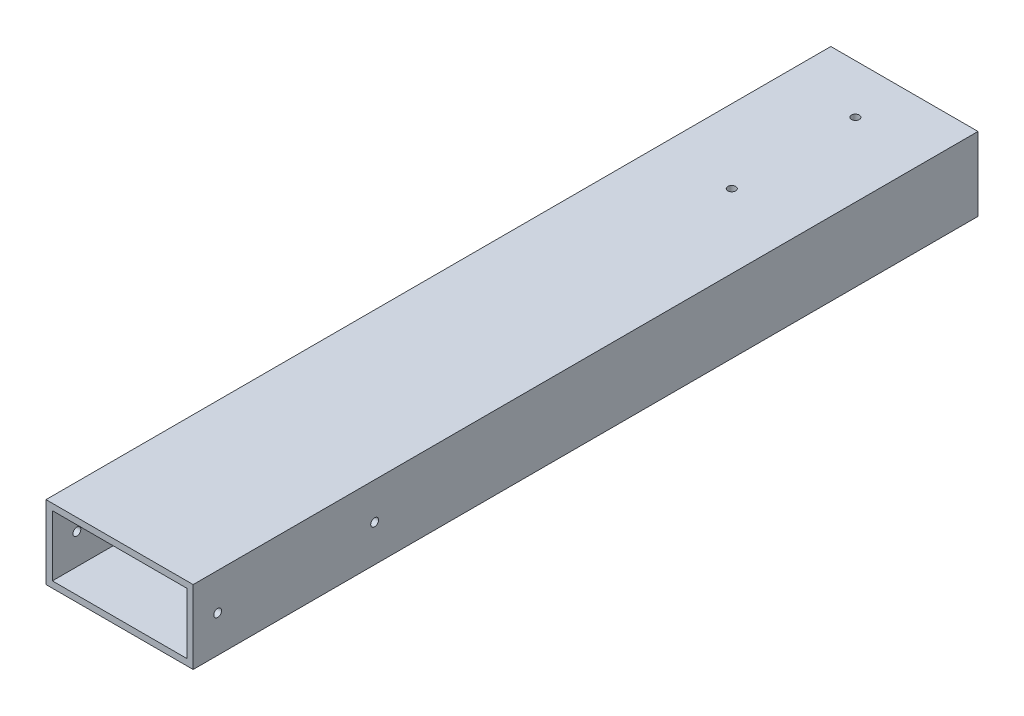
ISO-10303-21;
HEADER;
FILE_DESCRIPTION(('STEP AP214'),'2;1');
FILE_NAME('part.step','',(''),(''),'','','');
FILE_SCHEMA(('AUTOMOTIVE_DESIGN { 1 0 10303 214 1 1 1 1 }'));
ENDSEC;
DATA;
#1=APPLICATION_CONTEXT('core data for automotive mechanical design processes');
#2=APPLICATION_PROTOCOL_DEFINITION('international standard','automotive_design',2000,#1);
#3=PRODUCT_CONTEXT('',#1,'mechanical');
#4=PRODUCT('Part','Part','',(#3));
#5=PRODUCT_RELATED_PRODUCT_CATEGORY('part','',(#4));
#6=PRODUCT_DEFINITION_FORMATION('','',#4);
#7=PRODUCT_DEFINITION_CONTEXT('part definition',#1,'design');
#8=PRODUCT_DEFINITION('design','',#6,#7);
#9=PRODUCT_DEFINITION_SHAPE('','',#8);
#10=(LENGTH_UNIT() NAMED_UNIT(*) SI_UNIT(.MILLI.,.METRE.));
#11=(NAMED_UNIT(*) PLANE_ANGLE_UNIT() SI_UNIT($,.RADIAN.));
#12=(NAMED_UNIT(*) SI_UNIT($,.STERADIAN.) SOLID_ANGLE_UNIT());
#13=UNCERTAINTY_MEASURE_WITH_UNIT(LENGTH_MEASURE(1.E-05),#10,'distance_accuracy_value','');
#14=(GEOMETRIC_REPRESENTATION_CONTEXT(3) GLOBAL_UNCERTAINTY_ASSIGNED_CONTEXT((#13)) GLOBAL_UNIT_ASSIGNED_CONTEXT((#10,
#11,#12)) REPRESENTATION_CONTEXT('',''));
#15=CARTESIAN_POINT('',(0.,0.,0.));
#16=DIRECTION('',(0.,0.,1.));
#17=DIRECTION('',(1.,0.,0.));
#18=AXIS2_PLACEMENT_3D('',#15,#16,#17);
#19=CARTESIAN_POINT('',(-19.05,-9.525,203.2));
#20=DIRECTION('',(0.,0.,1.));
#21=DIRECTION('',(1.,0.,0.));
#22=AXIS2_PLACEMENT_3D('',#19,#20,#21);
#23=PLANE('',#22);
#24=DIRECTION('',(0.,-1.,0.));
#25=VECTOR('',#24,1.);
#26=CARTESIAN_POINT('',(-19.05,9.525,203.2));
#27=LINE('',#26,#25);
#28=CARTESIAN_POINT('',(-19.05,9.525,203.2));
#29=VERTEX_POINT('',#28);
#30=CARTESIAN_POINT('',(-19.05,-9.525,203.2));
#31=VERTEX_POINT('',#30);
#32=EDGE_CURVE('E138',#29,#31,#27,.T.);
#33=ORIENTED_EDGE('',*,*,#32,.T.);
#34=DIRECTION('',(1.,0.,0.));
#35=VECTOR('',#34,1.);
#36=CARTESIAN_POINT('',(-19.05,-9.525,203.2));
#37=LINE('',#36,#35);
#38=CARTESIAN_POINT('',(19.05,-9.525,203.2));
#39=VERTEX_POINT('',#38);
#40=EDGE_CURVE('E141',#31,#39,#37,.T.);
#41=ORIENTED_EDGE('',*,*,#40,.T.);
#42=DIRECTION('',(0.,1.,0.));
#43=VECTOR('',#42,1.);
#44=CARTESIAN_POINT('',(19.05,9.525,203.2));
#45=LINE('',#44,#43);
#46=CARTESIAN_POINT('',(19.05,9.525,203.2));
#47=VERTEX_POINT('',#46);
#48=EDGE_CURVE('E144',#39,#47,#45,.T.);
#49=ORIENTED_EDGE('',*,*,#48,.T.);
#50=DIRECTION('',(-1.,0.,0.));
#51=VECTOR('',#50,1.);
#52=CARTESIAN_POINT('',(-19.05,9.525,203.2));
#53=LINE('',#52,#51);
#54=EDGE_CURVE('E146',#47,#29,#53,.T.);
#55=ORIENTED_EDGE('',*,*,#54,.T.);
#56=EDGE_LOOP('',(#33,#41,#49,#55));
#57=FACE_BOUND('',#56,.T.);
#58=DIRECTION('',(1.,0.,0.));
#59=VECTOR('',#58,1.);
#60=CARTESIAN_POINT('',(-17.399,-7.874,203.2));
#61=LINE('',#60,#59);
#62=CARTESIAN_POINT('',(-17.399,-7.874,203.2));
#63=VERTEX_POINT('',#62);
#64=CARTESIAN_POINT('',(17.399,-7.874,203.2));
#65=VERTEX_POINT('',#64);
#66=EDGE_CURVE('E108',#63,#65,#61,.T.);
#67=ORIENTED_EDGE('',*,*,#66,.F.);
#68=DIRECTION('',(0.,-1.,0.));
#69=VECTOR('',#68,1.);
#70=CARTESIAN_POINT('',(-17.399,7.874,203.2));
#71=LINE('',#70,#69);
#72=CARTESIAN_POINT('',(-17.399,7.874,203.2));
#73=VERTEX_POINT('',#72);
#74=EDGE_CURVE('E100',#73,#63,#71,.T.);
#75=ORIENTED_EDGE('',*,*,#74,.F.);
#76=DIRECTION('',(-1.,0.,0.));
#77=VECTOR('',#76,1.);
#78=CARTESIAN_POINT('',(-17.399,7.874,203.2));
#79=LINE('',#78,#77);
#80=CARTESIAN_POINT('',(17.399,7.874,203.2));
#81=VERTEX_POINT('',#80);
#82=EDGE_CURVE('E122',#81,#73,#79,.T.);
#83=ORIENTED_EDGE('',*,*,#82,.F.);
#84=DIRECTION('',(0.,1.,0.));
#85=VECTOR('',#84,1.);
#86=CARTESIAN_POINT('',(17.399,7.874,203.2));
#87=LINE('',#86,#85);
#88=EDGE_CURVE('E120',#65,#81,#87,.T.);
#89=ORIENTED_EDGE('',*,*,#88,.F.);
#90=EDGE_LOOP('',(#67,#75,#83,#89));
#91=FACE_BOUND('',#90,.T.);
#92=ADVANCED_FACE('F33',(#57,#91),#23,.T.);
#93=CARTESIAN_POINT('',(-19.05,-9.525,0.));
#94=DIRECTION('',(0.,0.,1.));
#95=DIRECTION('',(1.,0.,0.));
#96=AXIS2_PLACEMENT_3D('',#93,#94,#95);
#97=PLANE('',#96);
#98=DIRECTION('',(0.,-1.,0.));
#99=VECTOR('',#98,1.);
#100=CARTESIAN_POINT('',(-19.05,9.525,0.));
#101=LINE('',#100,#99);
#102=CARTESIAN_POINT('',(-19.05,9.525,0.));
#103=VERTEX_POINT('',#102);
#104=CARTESIAN_POINT('',(-19.05,-9.525,0.));
#105=VERTEX_POINT('',#104);
#106=EDGE_CURVE('E116',#103,#105,#101,.T.);
#107=ORIENTED_EDGE('',*,*,#106,.F.);
#108=DIRECTION('',(-1.,0.,0.));
#109=VECTOR('',#108,1.);
#110=CARTESIAN_POINT('',(-19.05,9.525,0.));
#111=LINE('',#110,#109);
#112=CARTESIAN_POINT('',(19.05,9.525,0.));
#113=VERTEX_POINT('',#112);
#114=EDGE_CURVE('E142',#113,#103,#111,.T.);
#115=ORIENTED_EDGE('',*,*,#114,.F.);
#116=DIRECTION('',(0.,1.,0.));
#117=VECTOR('',#116,1.);
#118=CARTESIAN_POINT('',(19.05,9.525,0.));
#119=LINE('',#118,#117);
#120=CARTESIAN_POINT('',(19.05,-9.525,0.));
#121=VERTEX_POINT('',#120);
#122=EDGE_CURVE('E153',#121,#113,#119,.T.);
#123=ORIENTED_EDGE('',*,*,#122,.F.);
#124=DIRECTION('',(1.,0.,0.));
#125=VECTOR('',#124,1.);
#126=CARTESIAN_POINT('',(-19.05,-9.525,0.));
#127=LINE('',#126,#125);
#128=EDGE_CURVE('E151',#105,#121,#127,.T.);
#129=ORIENTED_EDGE('',*,*,#128,.F.);
#130=EDGE_LOOP('',(#107,#115,#123,#129));
#131=FACE_BOUND('',#130,.T.);
#132=DIRECTION('',(0.,-1.,0.));
#133=VECTOR('',#132,1.);
#134=CARTESIAN_POINT('',(-17.399,7.874,0.));
#135=LINE('',#134,#133);
#136=CARTESIAN_POINT('',(-17.399,7.874,0.));
#137=VERTEX_POINT('',#136);
#138=CARTESIAN_POINT('',(-17.399,-7.874,0.));
#139=VERTEX_POINT('',#138);
#140=EDGE_CURVE('E58',#137,#139,#135,.T.);
#141=ORIENTED_EDGE('',*,*,#140,.T.);
#142=DIRECTION('',(1.,0.,0.));
#143=VECTOR('',#142,1.);
#144=CARTESIAN_POINT('',(-17.399,-7.874,0.));
#145=LINE('',#144,#143);
#146=CARTESIAN_POINT('',(17.399,-7.874,0.));
#147=VERTEX_POINT('',#146);
#148=EDGE_CURVE('E115',#139,#147,#145,.T.);
#149=ORIENTED_EDGE('',*,*,#148,.T.);
#150=DIRECTION('',(0.,1.,0.));
#151=VECTOR('',#150,1.);
#152=CARTESIAN_POINT('',(17.399,7.874,0.));
#153=LINE('',#152,#151);
#154=CARTESIAN_POINT('',(17.399,7.874,0.));
#155=VERTEX_POINT('',#154);
#156=EDGE_CURVE('E130',#147,#155,#153,.T.);
#157=ORIENTED_EDGE('',*,*,#156,.T.);
#158=DIRECTION('',(-1.,0.,0.));
#159=VECTOR('',#158,1.);
#160=CARTESIAN_POINT('',(-17.399,7.874,0.));
#161=LINE('',#160,#159);
#162=EDGE_CURVE('E109',#155,#137,#161,.T.);
#163=ORIENTED_EDGE('',*,*,#162,.T.);
#164=EDGE_LOOP('',(#141,#149,#157,#163));
#165=FACE_BOUND('',#164,.T.);
#166=ADVANCED_FACE('F217',(#131,#165),#97,.F.);
#167=CARTESIAN_POINT('',(-19.05,9.525,203.2));
#168=DIRECTION('',(1.,0.,0.));
#169=DIRECTION('',(0.,0.,-1.));
#170=AXIS2_PLACEMENT_3D('',#167,#168,#169);
#171=PLANE('',#170);
#172=CARTESIAN_POINT('',(-19.05,0.,156.21));
#173=DIRECTION('',(1.,0.,0.));
#174=DIRECTION('',(0.,0.,-1.));
#175=AXIS2_PLACEMENT_3D('',#172,#173,#174);
#176=CIRCLE('',#175,1.01599999999998);
#177=CARTESIAN_POINT('',(-19.05,0.,155.194));
#178=VERTEX_POINT('',#177);
#179=EDGE_CURVE('E182',#178,#178,#176,.T.);
#180=ORIENTED_EDGE('',*,*,#179,.T.);
#181=EDGE_LOOP('',(#180));
#182=FACE_BOUND('',#181,.T.);
#183=CARTESIAN_POINT('',(-19.05,0.,196.85));
#184=DIRECTION('',(1.,0.,0.));
#185=DIRECTION('',(0.,0.,-1.));
#186=AXIS2_PLACEMENT_3D('',#183,#184,#185);
#187=CIRCLE('',#186,1.01599999999998);
#188=CARTESIAN_POINT('',(-19.05,0.,195.834));
#189=VERTEX_POINT('',#188);
#190=EDGE_CURVE('E164',#189,#189,#187,.T.);
#191=ORIENTED_EDGE('',*,*,#190,.T.);
#192=EDGE_LOOP('',(#191));
#193=FACE_BOUND('',#192,.T.);
#194=ORIENTED_EDGE('',*,*,#106,.T.);
#195=DIRECTION('',(0.,0.,-1.));
#196=VECTOR('',#195,1.);
#197=CARTESIAN_POINT('',(-19.05,-9.525,203.2));
#198=LINE('',#197,#196);
#199=EDGE_CURVE('E11',#31,#105,#198,.T.);
#200=ORIENTED_EDGE('',*,*,#199,.F.);
#201=ORIENTED_EDGE('',*,*,#32,.F.);
#202=DIRECTION('',(0.,0.,-1.));
#203=VECTOR('',#202,1.);
#204=CARTESIAN_POINT('',(-19.05,9.525,203.2));
#205=LINE('',#204,#203);
#206=EDGE_CURVE('E148',#29,#103,#205,.T.);
#207=ORIENTED_EDGE('',*,*,#206,.T.);
#208=EDGE_LOOP('',(#194,#200,#201,#207));
#209=FACE_BOUND('',#208,.T.);
#210=ADVANCED_FACE('F35',(#182,#193,#209),#171,.F.);
#211=CARTESIAN_POINT('',(-19.05,-9.525,203.2));
#212=DIRECTION('',(0.,1.,0.));
#213=DIRECTION('',(-1.,0.,0.));
#214=AXIS2_PLACEMENT_3D('',#211,#212,#213);
#215=PLANE('',#214);
#216=ORIENTED_EDGE('',*,*,#128,.T.);
#217=DIRECTION('',(0.,0.,-1.));
#218=VECTOR('',#217,1.);
#219=CARTESIAN_POINT('',(19.05,-9.525,203.2));
#220=LINE('',#219,#218);
#221=EDGE_CURVE('E42',#39,#121,#220,.T.);
#222=ORIENTED_EDGE('',*,*,#221,.F.);
#223=ORIENTED_EDGE('',*,*,#40,.F.);
#224=ORIENTED_EDGE('',*,*,#199,.T.);
#225=EDGE_LOOP('',(#216,#222,#223,#224));
#226=FACE_BOUND('',#225,.T.);
#227=ADVANCED_FACE('F221',(#226),#215,.F.);
#228=CARTESIAN_POINT('',(19.05,9.525,203.2));
#229=DIRECTION('',(-1.,0.,0.));
#230=DIRECTION('',(0.,0.,1.));
#231=AXIS2_PLACEMENT_3D('',#228,#229,#230);
#232=PLANE('',#231);
#233=CARTESIAN_POINT('',(19.05,0.,156.21));
#234=DIRECTION('',(1.,0.,0.));
#235=DIRECTION('',(0.,0.,-1.));
#236=AXIS2_PLACEMENT_3D('',#233,#234,#235);
#237=CIRCLE('',#236,1.01599999999998);
#238=CARTESIAN_POINT('',(19.05,0.,155.194));
#239=VERTEX_POINT('',#238);
#240=EDGE_CURVE('E179',#239,#239,#237,.T.);
#241=ORIENTED_EDGE('',*,*,#240,.F.);
#242=EDGE_LOOP('',(#241));
#243=FACE_BOUND('',#242,.T.);
#244=CARTESIAN_POINT('',(19.05,0.,196.85));
#245=DIRECTION('',(1.,0.,0.));
#246=DIRECTION('',(0.,0.,-1.));
#247=AXIS2_PLACEMENT_3D('',#244,#245,#246);
#248=CIRCLE('',#247,1.01599999999998);
#249=CARTESIAN_POINT('',(19.05,0.,195.834));
#250=VERTEX_POINT('',#249);
#251=EDGE_CURVE('E169',#250,#250,#248,.T.);
#252=ORIENTED_EDGE('',*,*,#251,.F.);
#253=EDGE_LOOP('',(#252));
#254=FACE_BOUND('',#253,.T.);
#255=ORIENTED_EDGE('',*,*,#122,.T.);
#256=DIRECTION('',(0.,0.,-1.));
#257=VECTOR('',#256,1.);
#258=CARTESIAN_POINT('',(19.05,9.525,203.2));
#259=LINE('',#258,#257);
#260=EDGE_CURVE('E158',#47,#113,#259,.T.);
#261=ORIENTED_EDGE('',*,*,#260,.F.);
#262=ORIENTED_EDGE('',*,*,#48,.F.);
#263=ORIENTED_EDGE('',*,*,#221,.T.);
#264=EDGE_LOOP('',(#255,#261,#262,#263));
#265=FACE_BOUND('',#264,.T.);
#266=ADVANCED_FACE('F203',(#243,#254,#265),#232,.F.);
#267=CARTESIAN_POINT('',(-19.05,9.525,203.2));
#268=DIRECTION('',(0.,-1.,0.));
#269=DIRECTION('',(0.,0.,-1.));
#270=AXIS2_PLACEMENT_3D('',#267,#268,#269);
#271=PLANE('',#270);
#272=CARTESIAN_POINT('',(0.,9.525,44.704));
#273=DIRECTION('',(0.,1.,0.));
#274=DIRECTION('',(0.,0.,1.));
#275=AXIS2_PLACEMENT_3D('',#272,#273,#274);
#276=CIRCLE('',#275,1.016);
#277=CARTESIAN_POINT('',(0.,9.525,45.72));
#278=VERTEX_POINT('',#277);
#279=EDGE_CURVE('E189',#278,#278,#276,.T.);
#280=ORIENTED_EDGE('',*,*,#279,.F.);
#281=EDGE_LOOP('',(#280));
#282=FACE_BOUND('',#281,.T.);
#283=CARTESIAN_POINT('',(0.,9.525,12.7));
#284=DIRECTION('',(0.,1.,0.));
#285=DIRECTION('',(0.,0.,1.));
#286=AXIS2_PLACEMENT_3D('',#283,#284,#285);
#287=CIRCLE('',#286,1.016);
#288=CARTESIAN_POINT('',(0.,9.525,13.716));
#289=VERTEX_POINT('',#288);
#290=EDGE_CURVE('E183',#289,#289,#287,.T.);
#291=ORIENTED_EDGE('',*,*,#290,.F.);
#292=EDGE_LOOP('',(#291));
#293=FACE_BOUND('',#292,.T.);
#294=ORIENTED_EDGE('',*,*,#114,.T.);
#295=ORIENTED_EDGE('',*,*,#206,.F.);
#296=ORIENTED_EDGE('',*,*,#54,.F.);
#297=ORIENTED_EDGE('',*,*,#260,.T.);
#298=EDGE_LOOP('',(#294,#295,#296,#297));
#299=FACE_BOUND('',#298,.T.);
#300=ADVANCED_FACE('F200',(#282,#293,#299),#271,.F.);
#301=CARTESIAN_POINT('',(-17.399,7.874,203.2));
#302=DIRECTION('',(1.,0.,0.));
#303=DIRECTION('',(0.,0.,-1.));
#304=AXIS2_PLACEMENT_3D('',#301,#302,#303);
#305=PLANE('',#304);
#306=CARTESIAN_POINT('',(-17.399,0.,156.21));
#307=DIRECTION('',(1.,0.,0.));
#308=DIRECTION('',(0.,0.,-1.));
#309=AXIS2_PLACEMENT_3D('',#306,#307,#308);
#310=CIRCLE('',#309,1.01599999999998);
#311=CARTESIAN_POINT('',(-17.399,0.,155.194));
#312=VERTEX_POINT('',#311);
#313=EDGE_CURVE('E174',#312,#312,#310,.T.);
#314=ORIENTED_EDGE('',*,*,#313,.F.);
#315=EDGE_LOOP('',(#314));
#316=FACE_BOUND('',#315,.T.);
#317=CARTESIAN_POINT('',(-17.399,0.,196.85));
#318=DIRECTION('',(1.,0.,0.));
#319=DIRECTION('',(0.,0.,-1.));
#320=AXIS2_PLACEMENT_3D('',#317,#318,#319);
#321=CIRCLE('',#320,1.01599999999998);
#322=CARTESIAN_POINT('',(-17.399,0.,195.834));
#323=VERTEX_POINT('',#322);
#324=EDGE_CURVE('E128',#323,#323,#321,.T.);
#325=ORIENTED_EDGE('',*,*,#324,.F.);
#326=EDGE_LOOP('',(#325));
#327=FACE_BOUND('',#326,.T.);
#328=ORIENTED_EDGE('',*,*,#140,.F.);
#329=DIRECTION('',(0.,0.,-1.));
#330=VECTOR('',#329,1.);
#331=CARTESIAN_POINT('',(-17.399,7.874,203.2));
#332=LINE('',#331,#330);
#333=EDGE_CURVE('E104',#73,#137,#332,.T.);
#334=ORIENTED_EDGE('',*,*,#333,.F.);
#335=ORIENTED_EDGE('',*,*,#74,.T.);
#336=DIRECTION('',(0.,0.,-1.));
#337=VECTOR('',#336,1.);
#338=CARTESIAN_POINT('',(-17.399,-7.874,203.2));
#339=LINE('',#338,#337);
#340=EDGE_CURVE('E103',#63,#139,#339,.T.);
#341=ORIENTED_EDGE('',*,*,#340,.T.);
#342=EDGE_LOOP('',(#328,#334,#335,#341));
#343=FACE_BOUND('',#342,.T.);
#344=ADVANCED_FACE('F102',(#316,#327,#343),#305,.T.);
#345=CARTESIAN_POINT('',(-17.399,-7.874,203.2));
#346=DIRECTION('',(0.,1.,0.));
#347=DIRECTION('',(0.,0.,1.));
#348=AXIS2_PLACEMENT_3D('',#345,#346,#347);
#349=PLANE('',#348);
#350=ORIENTED_EDGE('',*,*,#148,.F.);
#351=ORIENTED_EDGE('',*,*,#340,.F.);
#352=ORIENTED_EDGE('',*,*,#66,.T.);
#353=DIRECTION('',(0.,0.,-1.));
#354=VECTOR('',#353,1.);
#355=CARTESIAN_POINT('',(17.399,-7.874,203.2));
#356=LINE('',#355,#354);
#357=EDGE_CURVE('E117',#65,#147,#356,.T.);
#358=ORIENTED_EDGE('',*,*,#357,.T.);
#359=EDGE_LOOP('',(#350,#351,#352,#358));
#360=FACE_BOUND('',#359,.T.);
#361=ADVANCED_FACE('F112',(#360),#349,.T.);
#362=CARTESIAN_POINT('',(17.399,7.874,203.2));
#363=DIRECTION('',(-1.,0.,0.));
#364=DIRECTION('',(0.,0.,1.));
#365=AXIS2_PLACEMENT_3D('',#362,#363,#364);
#366=PLANE('',#365);
#367=CARTESIAN_POINT('',(17.399,0.,156.21));
#368=DIRECTION('',(-1.,0.,0.));
#369=DIRECTION('',(0.,0.,1.));
#370=AXIS2_PLACEMENT_3D('',#367,#368,#369);
#371=CIRCLE('',#370,1.01599999999998);
#372=CARTESIAN_POINT('',(17.399,0.,157.226));
#373=VERTEX_POINT('',#372);
#374=EDGE_CURVE('E37',#373,#373,#371,.T.);
#375=ORIENTED_EDGE('',*,*,#374,.F.);
#376=EDGE_LOOP('',(#375));
#377=FACE_BOUND('',#376,.T.);
#378=CARTESIAN_POINT('',(17.399,0.,196.85));
#379=DIRECTION('',(-1.,0.,0.));
#380=DIRECTION('',(0.,0.,1.));
#381=AXIS2_PLACEMENT_3D('',#378,#379,#380);
#382=CIRCLE('',#381,1.01599999999998);
#383=CARTESIAN_POINT('',(17.399,0.,197.866));
#384=VERTEX_POINT('',#383);
#385=EDGE_CURVE('E162',#384,#384,#382,.T.);
#386=ORIENTED_EDGE('',*,*,#385,.F.);
#387=EDGE_LOOP('',(#386));
#388=FACE_BOUND('',#387,.T.);
#389=ORIENTED_EDGE('',*,*,#156,.F.);
#390=ORIENTED_EDGE('',*,*,#357,.F.);
#391=ORIENTED_EDGE('',*,*,#88,.T.);
#392=DIRECTION('',(0.,0.,-1.));
#393=VECTOR('',#392,1.);
#394=CARTESIAN_POINT('',(17.399,7.874,203.2));
#395=LINE('',#394,#393);
#396=EDGE_CURVE('E50',#81,#155,#395,.T.);
#397=ORIENTED_EDGE('',*,*,#396,.T.);
#398=EDGE_LOOP('',(#389,#390,#391,#397));
#399=FACE_BOUND('',#398,.T.);
#400=ADVANCED_FACE('F245',(#377,#388,#399),#366,.T.);
#401=CARTESIAN_POINT('',(-17.399,7.874,203.2));
#402=DIRECTION('',(0.,-1.,0.));
#403=DIRECTION('',(0.,0.,-1.));
#404=AXIS2_PLACEMENT_3D('',#401,#402,#403);
#405=PLANE('',#404);
#406=CARTESIAN_POINT('',(0.,7.874,44.704));
#407=DIRECTION('',(0.,-1.,0.));
#408=DIRECTION('',(0.,0.,-1.));
#409=AXIS2_PLACEMENT_3D('',#406,#407,#408);
#410=CIRCLE('',#409,1.016);
#411=CARTESIAN_POINT('',(0.,7.874,43.688));
#412=VERTEX_POINT('',#411);
#413=EDGE_CURVE('E192',#412,#412,#410,.F.);
#414=ORIENTED_EDGE('',*,*,#413,.T.);
#415=EDGE_LOOP('',(#414));
#416=FACE_BOUND('',#415,.T.);
#417=CARTESIAN_POINT('',(0.,7.874,12.7));
#418=DIRECTION('',(0.,-1.,0.));
#419=DIRECTION('',(0.,0.,-1.));
#420=AXIS2_PLACEMENT_3D('',#417,#418,#419);
#421=CIRCLE('',#420,1.016);
#422=CARTESIAN_POINT('',(0.,7.874,11.684));
#423=VERTEX_POINT('',#422);
#424=EDGE_CURVE('E186',#423,#423,#421,.F.);
#425=ORIENTED_EDGE('',*,*,#424,.T.);
#426=EDGE_LOOP('',(#425));
#427=FACE_BOUND('',#426,.T.);
#428=ORIENTED_EDGE('',*,*,#162,.F.);
#429=ORIENTED_EDGE('',*,*,#396,.F.);
#430=ORIENTED_EDGE('',*,*,#82,.T.);
#431=ORIENTED_EDGE('',*,*,#333,.T.);
#432=EDGE_LOOP('',(#428,#429,#430,#431));
#433=FACE_BOUND('',#432,.T.);
#434=ADVANCED_FACE('F248',(#416,#427,#433),#405,.T.);
#435=CARTESIAN_POINT('',(-19.05,0.,196.85));
#436=DIRECTION('',(1.,0.,0.));
#437=DIRECTION('',(0.,0.,-1.));
#438=AXIS2_PLACEMENT_3D('',#435,#436,#437);
#439=CYLINDRICAL_SURFACE('',#438,1.01599999999998);
#440=ORIENTED_EDGE('',*,*,#385,.T.);
#441=EDGE_LOOP('',(#440));
#442=FACE_BOUND('',#441,.T.);
#443=ORIENTED_EDGE('',*,*,#251,.T.);
#444=EDGE_LOOP('',(#443));
#445=FACE_BOUND('',#444,.T.);
#446=ADVANCED_FACE('F252',(#442,#445),#439,.F.);
#447=ORIENTED_EDGE('',*,*,#324,.T.);
#448=EDGE_LOOP('',(#447));
#449=FACE_BOUND('',#448,.T.);
#450=ORIENTED_EDGE('',*,*,#190,.F.);
#451=EDGE_LOOP('',(#450));
#452=FACE_BOUND('',#451,.T.);
#453=ADVANCED_FACE('F256',(#449,#452),#439,.F.);
#454=CARTESIAN_POINT('',(-19.05,0.,156.21));
#455=DIRECTION('',(1.,0.,0.));
#456=DIRECTION('',(0.,0.,-1.));
#457=AXIS2_PLACEMENT_3D('',#454,#455,#456);
#458=CYLINDRICAL_SURFACE('',#457,1.01599999999998);
#459=ORIENTED_EDGE('',*,*,#374,.T.);
#460=EDGE_LOOP('',(#459));
#461=FACE_BOUND('',#460,.T.);
#462=ORIENTED_EDGE('',*,*,#240,.T.);
#463=EDGE_LOOP('',(#462));
#464=FACE_BOUND('',#463,.T.);
#465=ADVANCED_FACE('F257',(#461,#464),#458,.F.);
#466=ORIENTED_EDGE('',*,*,#313,.T.);
#467=EDGE_LOOP('',(#466));
#468=FACE_BOUND('',#467,.T.);
#469=ORIENTED_EDGE('',*,*,#179,.F.);
#470=EDGE_LOOP('',(#469));
#471=FACE_BOUND('',#470,.T.);
#472=ADVANCED_FACE('F260',(#468,#471),#458,.F.);
#473=CARTESIAN_POINT('',(0.,-9.526,12.7));
#474=DIRECTION('',(0.,1.,0.));
#475=DIRECTION('',(0.,0.,1.));
#476=AXIS2_PLACEMENT_3D('',#473,#474,#475);
#477=CYLINDRICAL_SURFACE('',#476,1.016);
#478=ORIENTED_EDGE('',*,*,#424,.F.);
#479=EDGE_LOOP('',(#478));
#480=FACE_BOUND('',#479,.T.);
#481=ORIENTED_EDGE('',*,*,#290,.T.);
#482=EDGE_LOOP('',(#481));
#483=FACE_BOUND('',#482,.T.);
#484=ADVANCED_FACE('F262',(#480,#483),#477,.F.);
#485=CARTESIAN_POINT('',(0.,-9.526,44.704));
#486=DIRECTION('',(0.,1.,0.));
#487=DIRECTION('',(0.,0.,1.));
#488=AXIS2_PLACEMENT_3D('',#485,#486,#487);
#489=CYLINDRICAL_SURFACE('',#488,1.016);
#490=ORIENTED_EDGE('',*,*,#413,.F.);
#491=EDGE_LOOP('',(#490));
#492=FACE_BOUND('',#491,.T.);
#493=ORIENTED_EDGE('',*,*,#279,.T.);
#494=EDGE_LOOP('',(#493));
#495=FACE_BOUND('',#494,.T.);
#496=ADVANCED_FACE('F198',(#492,#495),#489,.F.);
#497=CLOSED_SHELL('',(#92,#166,#210,#227,#266,#300,#344,#361,#400,#434,#446,#453,#465,#472,#484,#496));
#498=MANIFOLD_SOLID_BREP('B2',#497);
#499=ADVANCED_BREP_SHAPE_REPRESENTATION('',(#18,#498),#14);
#500=SHAPE_DEFINITION_REPRESENTATION(#9,#499);
ENDSEC;
END-ISO-10303-21;
